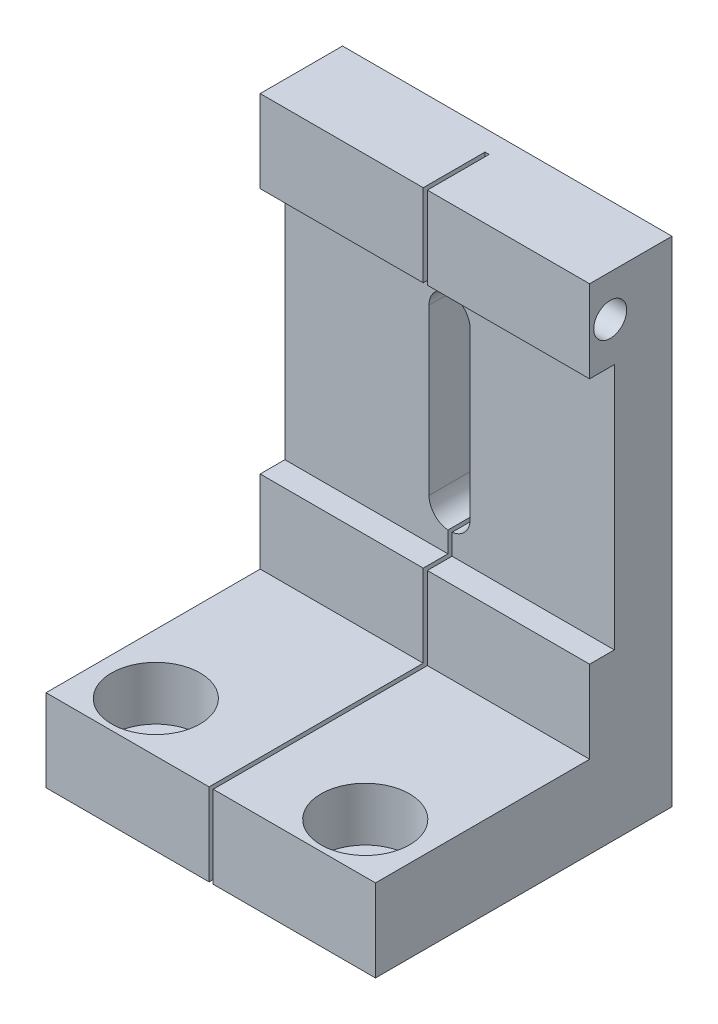
ISO-10303-21;
HEADER;
FILE_DESCRIPTION(('STEP AP214'),'2;1');
FILE_NAME('part.step','',(''),(''),'','','');
FILE_SCHEMA(('AUTOMOTIVE_DESIGN { 1 0 10303 214 1 1 1 1 }'));
ENDSEC;
DATA;
#1=APPLICATION_CONTEXT('core data for automotive mechanical design processes');
#2=APPLICATION_PROTOCOL_DEFINITION('international standard','automotive_design',2000,#1);
#3=PRODUCT_CONTEXT('',#1,'mechanical');
#4=PRODUCT('Part','Part','',(#3));
#5=PRODUCT_RELATED_PRODUCT_CATEGORY('part','',(#4));
#6=PRODUCT_DEFINITION_FORMATION('','',#4);
#7=PRODUCT_DEFINITION_CONTEXT('part definition',#1,'design');
#8=PRODUCT_DEFINITION('design','',#6,#7);
#9=PRODUCT_DEFINITION_SHAPE('','',#8);
#10=(LENGTH_UNIT() NAMED_UNIT(*) SI_UNIT(.MILLI.,.METRE.));
#11=(NAMED_UNIT(*) PLANE_ANGLE_UNIT() SI_UNIT($,.RADIAN.));
#12=(NAMED_UNIT(*) SI_UNIT($,.STERADIAN.) SOLID_ANGLE_UNIT());
#13=UNCERTAINTY_MEASURE_WITH_UNIT(LENGTH_MEASURE(1.E-05),#10,'distance_accuracy_value','');
#14=(GEOMETRIC_REPRESENTATION_CONTEXT(3) GLOBAL_UNCERTAINTY_ASSIGNED_CONTEXT((#13)) GLOBAL_UNIT_ASSIGNED_CONTEXT((#10,
#11,#12)) REPRESENTATION_CONTEXT('',''));
#15=CARTESIAN_POINT('',(0.,0.,0.));
#16=DIRECTION('',(0.,0.,1.));
#17=DIRECTION('',(1.,0.,0.));
#18=AXIS2_PLACEMENT_3D('',#15,#16,#17);
#19=CARTESIAN_POINT('',(-7.29999999999999,-40.383347775863,29.94));
#20=DIRECTION('',(0.,-1.,0.));
#21=DIRECTION('',(0.,0.,-1.));
#22=AXIS2_PLACEMENT_3D('',#19,#20,#21);
#23=CYLINDRICAL_SURFACE('',#22,3.4);
#24=CARTESIAN_POINT('',(-7.29999999999999,-60.,29.94));
#25=DIRECTION('',(0.,-1.,0.));
#26=DIRECTION('',(0.,0.,-1.));
#27=AXIS2_PLACEMENT_3D('',#24,#25,#26);
#28=CIRCLE('',#27,3.4);
#29=CARTESIAN_POINT('',(-7.29999999999999,-60.,26.54));
#30=VERTEX_POINT('',#29);
#31=EDGE_CURVE('E469',#30,#30,#28,.T.);
#32=ORIENTED_EDGE('',*,*,#31,.T.);
#33=EDGE_LOOP('',(#32));
#34=FACE_BOUND('',#33,.T.);
#35=CARTESIAN_POINT('',(-7.29999999999999,-56.5,29.94));
#36=DIRECTION('',(0.,1.,0.));
#37=DIRECTION('',(-1.,0.,0.));
#38=AXIS2_PLACEMENT_3D('',#35,#36,#37);
#39=CIRCLE('',#38,3.4);
#40=CARTESIAN_POINT('',(-10.7,-56.5,29.94));
#41=VERTEX_POINT('',#40);
#42=EDGE_CURVE('E39',#41,#41,#39,.F.);
#43=ORIENTED_EDGE('',*,*,#42,.F.);
#44=EDGE_LOOP('',(#43));
#45=FACE_BOUND('',#44,.T.);
#46=ADVANCED_FACE('F35',(#34,#45),#23,.F.);
#47=CARTESIAN_POINT('',(-32.73,-40.383347775863,29.94));
#48=DIRECTION('',(0.,-1.,0.));
#49=DIRECTION('',(0.,0.,-1.));
#50=AXIS2_PLACEMENT_3D('',#47,#48,#49);
#51=CYLINDRICAL_SURFACE('',#50,3.4);
#52=CARTESIAN_POINT('',(-32.73,-60.,29.94));
#53=DIRECTION('',(0.,-1.,0.));
#54=DIRECTION('',(0.,0.,-1.));
#55=AXIS2_PLACEMENT_3D('',#52,#53,#54);
#56=CIRCLE('',#55,3.4);
#57=CARTESIAN_POINT('',(-32.73,-60.,26.54));
#58=VERTEX_POINT('',#57);
#59=EDGE_CURVE('E460',#58,#58,#56,.T.);
#60=ORIENTED_EDGE('',*,*,#59,.T.);
#61=EDGE_LOOP('',(#60));
#62=FACE_BOUND('',#61,.T.);
#63=CARTESIAN_POINT('',(-32.73,-56.5,29.94));
#64=DIRECTION('',(0.,1.,0.));
#65=DIRECTION('',(-1.,0.,0.));
#66=AXIS2_PLACEMENT_3D('',#63,#64,#65);
#67=CIRCLE('',#66,3.4);
#68=CARTESIAN_POINT('',(-36.13,-56.5,29.94));
#69=VERTEX_POINT('',#68);
#70=EDGE_CURVE('E438',#69,#69,#67,.F.);
#71=ORIENTED_EDGE('',*,*,#70,.F.);
#72=EDGE_LOOP('',(#71));
#73=FACE_BOUND('',#72,.T.);
#74=ADVANCED_FACE('F583',(#62,#73),#51,.F.);
#75=CARTESIAN_POINT('',(0.,0.,10.));
#76=DIRECTION('',(0.,0.,-1.));
#77=DIRECTION('',(-1.,0.,0.));
#78=AXIS2_PLACEMENT_3D('',#75,#76,#77);
#79=PLANE('',#78);
#80=DIRECTION('',(1.,0.,0.));
#81=VECTOR('',#80,1.);
#82=CARTESIAN_POINT('',(-40.,-40.,10.));
#83=LINE('',#82,#81);
#84=CARTESIAN_POINT('',(-19.7,-40.,10.));
#85=VERTEX_POINT('',#84);
#86=CARTESIAN_POINT('',(0.,-40.,10.));
#87=VERTEX_POINT('',#86);
#88=EDGE_CURVE('E343',#85,#87,#83,.T.);
#89=ORIENTED_EDGE('',*,*,#88,.F.);
#90=DIRECTION('',(0.,-1.,0.));
#91=VECTOR('',#90,1.);
#92=CARTESIAN_POINT('',(-19.7,0.,10.));
#93=LINE('',#92,#91);
#94=CARTESIAN_POINT('',(-19.7,-50.,10.));
#95=VERTEX_POINT('',#94);
#96=EDGE_CURVE('E288',#85,#95,#93,.T.);
#97=ORIENTED_EDGE('',*,*,#96,.T.);
#98=DIRECTION('',(-1.,0.,0.));
#99=VECTOR('',#98,1.);
#100=CARTESIAN_POINT('',(0.,-50.,10.));
#101=LINE('',#100,#99);
#102=CARTESIAN_POINT('',(0.,-50.,10.));
#103=VERTEX_POINT('',#102);
#104=EDGE_CURVE('E313',#103,#95,#101,.T.);
#105=ORIENTED_EDGE('',*,*,#104,.F.);
#106=DIRECTION('',(0.,1.,0.));
#107=VECTOR('',#106,1.);
#108=CARTESIAN_POINT('',(0.,0.,10.));
#109=LINE('',#108,#107);
#110=EDGE_CURVE('E402',#103,#87,#109,.T.);
#111=ORIENTED_EDGE('',*,*,#110,.T.);
#112=EDGE_LOOP('',(#89,#97,#105,#111));
#113=FACE_BOUND('',#112,.T.);
#114=ADVANCED_FACE('F503',(#113),#79,.F.);
#115=DIRECTION('',(-1.,0.,0.));
#116=VECTOR('',#115,1.);
#117=CARTESIAN_POINT('',(0.,0.,10.));
#118=LINE('',#117,#116);
#119=CARTESIAN_POINT('',(0.,0.,10.));
#120=VERTEX_POINT('',#119);
#121=CARTESIAN_POINT('',(-19.7,0.,10.));
#122=VERTEX_POINT('',#121);
#123=EDGE_CURVE('E407',#120,#122,#118,.T.);
#124=ORIENTED_EDGE('',*,*,#123,.T.);
#125=DIRECTION('',(0.,-1.,0.));
#126=VECTOR('',#125,1.);
#127=CARTESIAN_POINT('',(-19.7,0.,10.));
#128=LINE('',#127,#126);
#129=CARTESIAN_POINT('',(-19.7,-10.,10.));
#130=VERTEX_POINT('',#129);
#131=EDGE_CURVE('E228',#122,#130,#128,.T.);
#132=ORIENTED_EDGE('',*,*,#131,.T.);
#133=DIRECTION('',(1.,0.,0.));
#134=VECTOR('',#133,1.);
#135=CARTESIAN_POINT('',(-40.,-10.,10.));
#136=LINE('',#135,#134);
#137=CARTESIAN_POINT('',(0.,-10.,10.));
#138=VERTEX_POINT('',#137);
#139=EDGE_CURVE('E355',#130,#138,#136,.T.);
#140=ORIENTED_EDGE('',*,*,#139,.T.);
#141=EDGE_CURVE('E406',#138,#120,#109,.T.);
#142=ORIENTED_EDGE('',*,*,#141,.T.);
#143=EDGE_LOOP('',(#124,#132,#140,#142));
#144=FACE_BOUND('',#143,.T.);
#145=ADVANCED_FACE('F536',(#144),#79,.F.);
#146=CARTESIAN_POINT('',(-40.,-10.,7.));
#147=DIRECTION('',(0.,0.,-1.));
#148=DIRECTION('',(0.,1.,0.));
#149=AXIS2_PLACEMENT_3D('',#146,#147,#148);
#150=PLANE('',#149);
#151=DIRECTION('',(1.,0.,0.));
#152=VECTOR('',#151,1.);
#153=CARTESIAN_POINT('',(-40.,-10.,7.));
#154=LINE('',#153,#152);
#155=CARTESIAN_POINT('',(-19.7,-10.,7.));
#156=VERTEX_POINT('',#155);
#157=CARTESIAN_POINT('',(0.,-10.,7.));
#158=VERTEX_POINT('',#157);
#159=EDGE_CURVE('E359',#156,#158,#154,.T.);
#160=ORIENTED_EDGE('',*,*,#159,.F.);
#161=DIRECTION('',(0.,-1.,0.));
#162=VECTOR('',#161,1.);
#163=CARTESIAN_POINT('',(-19.7,-10.,7.));
#164=LINE('',#163,#162);
#165=CARTESIAN_POINT('',(-19.7,-12.5180652708018,7.));
#166=VERTEX_POINT('',#165);
#167=EDGE_CURVE('E298',#156,#166,#164,.T.);
#168=ORIENTED_EDGE('',*,*,#167,.T.);
#169=CARTESIAN_POINT('',(-20.,-15.,7.));
#170=DIRECTION('',(0.,0.,-1.));
#171=DIRECTION('',(0.,1.,0.));
#172=AXIS2_PLACEMENT_3D('',#169,#170,#171);
#173=CIRCLE('',#172,2.5);
#174=CARTESIAN_POINT('',(-17.5,-15.,7.));
#175=VERTEX_POINT('',#174);
#176=EDGE_CURVE('E374',#175,#166,#173,.F.);
#177=ORIENTED_EDGE('',*,*,#176,.F.);
#178=DIRECTION('',(0.,1.,0.));
#179=VECTOR('',#178,1.);
#180=CARTESIAN_POINT('',(-17.5,-15.,7.));
#181=LINE('',#180,#179);
#182=CARTESIAN_POINT('',(-17.5,-35.,7.));
#183=VERTEX_POINT('',#182);
#184=EDGE_CURVE('E370',#183,#175,#181,.T.);
#185=ORIENTED_EDGE('',*,*,#184,.F.);
#186=CARTESIAN_POINT('',(-20.,-35.,7.));
#187=DIRECTION('',(0.,0.,-1.));
#188=DIRECTION('',(0.,1.,0.));
#189=AXIS2_PLACEMENT_3D('',#186,#187,#188);
#190=CIRCLE('',#189,2.5);
#191=CARTESIAN_POINT('',(-19.7,-37.4819347291982,7.));
#192=VERTEX_POINT('',#191);
#193=EDGE_CURVE('E354',#192,#183,#190,.F.);
#194=ORIENTED_EDGE('',*,*,#193,.F.);
#195=CARTESIAN_POINT('',(-19.7,-40.,7.));
#196=VERTEX_POINT('',#195);
#197=EDGE_CURVE('E294',#192,#196,#164,.T.);
#198=ORIENTED_EDGE('',*,*,#197,.T.);
#199=DIRECTION('',(1.,0.,0.));
#200=VECTOR('',#199,1.);
#201=CARTESIAN_POINT('',(-40.,-40.,7.));
#202=LINE('',#201,#200);
#203=CARTESIAN_POINT('',(0.,-40.,7.));
#204=VERTEX_POINT('',#203);
#205=EDGE_CURVE('E363',#196,#204,#202,.T.);
#206=ORIENTED_EDGE('',*,*,#205,.T.);
#207=DIRECTION('',(0.,1.,0.));
#208=VECTOR('',#207,1.);
#209=CARTESIAN_POINT('',(0.,-10.,7.));
#210=LINE('',#209,#208);
#211=EDGE_CURVE('E346',#204,#158,#210,.T.);
#212=ORIENTED_EDGE('',*,*,#211,.T.);
#213=EDGE_LOOP('',(#160,#168,#177,#185,#194,#198,#206,#212));
#214=FACE_BOUND('',#213,.T.);
#215=ADVANCED_FACE('F511',(#214),#150,.F.);
#216=CARTESIAN_POINT('',(-40.,-10.,7.));
#217=DIRECTION('',(0.,1.,0.));
#218=DIRECTION('',(-1.,0.,0.));
#219=AXIS2_PLACEMENT_3D('',#216,#217,#218);
#220=PLANE('',#219);
#221=ORIENTED_EDGE('',*,*,#139,.F.);
#222=DIRECTION('',(0.,0.,-1.));
#223=VECTOR('',#222,1.);
#224=CARTESIAN_POINT('',(-19.7,-10.,7.));
#225=LINE('',#224,#223);
#226=EDGE_CURVE('E301',#130,#156,#225,.T.);
#227=ORIENTED_EDGE('',*,*,#226,.T.);
#228=ORIENTED_EDGE('',*,*,#159,.T.);
#229=DIRECTION('',(0.,0.,1.));
#230=VECTOR('',#229,1.);
#231=CARTESIAN_POINT('',(0.,-10.,7.));
#232=LINE('',#231,#230);
#233=EDGE_CURVE('E337',#158,#138,#232,.T.);
#234=ORIENTED_EDGE('',*,*,#233,.T.);
#235=EDGE_LOOP('',(#221,#227,#228,#234));
#236=FACE_BOUND('',#235,.T.);
#237=ADVANCED_FACE('F539',(#236),#220,.F.);
#238=CARTESIAN_POINT('',(-40.,-40.,7.));
#239=DIRECTION('',(0.,-1.,0.));
#240=DIRECTION('',(1.,0.,0.));
#241=AXIS2_PLACEMENT_3D('',#238,#239,#240);
#242=PLANE('',#241);
#243=ORIENTED_EDGE('',*,*,#205,.F.);
#244=DIRECTION('',(0.,0.,1.));
#245=VECTOR('',#244,1.);
#246=CARTESIAN_POINT('',(-19.7,-40.,7.));
#247=LINE('',#246,#245);
#248=EDGE_CURVE('E291',#196,#85,#247,.T.);
#249=ORIENTED_EDGE('',*,*,#248,.T.);
#250=ORIENTED_EDGE('',*,*,#88,.T.);
#251=DIRECTION('',(0.,0.,-1.));
#252=VECTOR('',#251,1.);
#253=CARTESIAN_POINT('',(0.,-40.,7.));
#254=LINE('',#253,#252);
#255=EDGE_CURVE('E332',#87,#204,#254,.T.);
#256=ORIENTED_EDGE('',*,*,#255,.T.);
#257=EDGE_LOOP('',(#243,#249,#250,#256));
#258=FACE_BOUND('',#257,.T.);
#259=ADVANCED_FACE('F506',(#258),#242,.F.);
#260=CARTESIAN_POINT('',(0.,-50.,36.));
#261=DIRECTION('',(0.,-1.,0.));
#262=DIRECTION('',(1.,0.,0.));
#263=AXIS2_PLACEMENT_3D('',#260,#261,#262);
#264=PLANE('',#263);
#265=CARTESIAN_POINT('',(-7.29999999999999,-50.,29.94));
#266=DIRECTION('',(0.,1.,0.));
#267=DIRECTION('',(-1.,0.,0.));
#268=AXIS2_PLACEMENT_3D('',#265,#266,#267);
#269=CIRCLE('',#268,5.375);
#270=CARTESIAN_POINT('',(-12.675,-50.,29.94));
#271=VERTEX_POINT('',#270);
#272=EDGE_CURVE('E455',#271,#271,#269,.T.);
#273=ORIENTED_EDGE('',*,*,#272,.F.);
#274=EDGE_LOOP('',(#273));
#275=FACE_BOUND('',#274,.T.);
#276=ORIENTED_EDGE('',*,*,#104,.T.);
#277=DIRECTION('',(0.,0.,1.));
#278=VECTOR('',#277,1.);
#279=CARTESIAN_POINT('',(-19.7,-50.,36.));
#280=LINE('',#279,#278);
#281=CARTESIAN_POINT('',(-19.7,-50.,36.));
#282=VERTEX_POINT('',#281);
#283=EDGE_CURVE('E285',#95,#282,#280,.T.);
#284=ORIENTED_EDGE('',*,*,#283,.T.);
#285=DIRECTION('',(-1.,0.,0.));
#286=VECTOR('',#285,1.);
#287=CARTESIAN_POINT('',(0.,-50.,36.));
#288=LINE('',#287,#286);
#289=CARTESIAN_POINT('',(0.,-50.,36.));
#290=VERTEX_POINT('',#289);
#291=EDGE_CURVE('E314',#290,#282,#288,.T.);
#292=ORIENTED_EDGE('',*,*,#291,.F.);
#293=DIRECTION('',(0.,0.,-1.));
#294=VECTOR('',#293,1.);
#295=CARTESIAN_POINT('',(0.,-50.,36.));
#296=LINE('',#295,#294);
#297=EDGE_CURVE('E329',#290,#103,#296,.T.);
#298=ORIENTED_EDGE('',*,*,#297,.T.);
#299=EDGE_LOOP('',(#276,#284,#292,#298));
#300=FACE_BOUND('',#299,.T.);
#301=ADVANCED_FACE('F500',(#275,#300),#264,.F.);
#302=CARTESIAN_POINT('',(0.,0.,36.));
#303=DIRECTION('',(0.,0.,1.));
#304=DIRECTION('',(1.,0.,0.));
#305=AXIS2_PLACEMENT_3D('',#302,#303,#304);
#306=PLANE('',#305);
#307=DIRECTION('',(0.,1.,0.));
#308=VECTOR('',#307,1.);
#309=CARTESIAN_POINT('',(-19.7,-93.5037311355019,36.));
#310=LINE('',#309,#308);
#311=CARTESIAN_POINT('',(-19.7,-60.,36.));
#312=VERTEX_POINT('',#311);
#313=EDGE_CURVE('E252',#312,#282,#310,.T.);
#314=ORIENTED_EDGE('',*,*,#313,.F.);
#315=DIRECTION('',(1.,0.,0.));
#316=VECTOR('',#315,1.);
#317=CARTESIAN_POINT('',(0.,-60.,36.));
#318=LINE('',#317,#316);
#319=CARTESIAN_POINT('',(0.,-60.,36.));
#320=VERTEX_POINT('',#319);
#321=EDGE_CURVE('E320',#312,#320,#318,.T.);
#322=ORIENTED_EDGE('',*,*,#321,.T.);
#323=DIRECTION('',(0.,1.,0.));
#324=VECTOR('',#323,1.);
#325=CARTESIAN_POINT('',(0.,-60.,36.));
#326=LINE('',#325,#324);
#327=EDGE_CURVE('E309',#320,#290,#326,.T.);
#328=ORIENTED_EDGE('',*,*,#327,.T.);
#329=ORIENTED_EDGE('',*,*,#291,.T.);
#330=EDGE_LOOP('',(#314,#322,#328,#329));
#331=FACE_BOUND('',#330,.T.);
#332=ADVANCED_FACE('F488',(#331),#306,.T.);
#333=CARTESIAN_POINT('',(-20.2,-50.,10.));
#334=VERTEX_POINT('',#333);
#335=CARTESIAN_POINT('',(-40.,-50.,10.));
#336=VERTEX_POINT('',#335);
#337=EDGE_CURVE('E308',#334,#336,#101,.T.);
#338=ORIENTED_EDGE('',*,*,#337,.F.);
#339=DIRECTION('',(0.,1.,0.));
#340=VECTOR('',#339,1.);
#341=CARTESIAN_POINT('',(-20.2,0.,10.));
#342=LINE('',#341,#340);
#343=CARTESIAN_POINT('',(-20.2,-40.,10.));
#344=VERTEX_POINT('',#343);
#345=EDGE_CURVE('E266',#334,#344,#342,.T.);
#346=ORIENTED_EDGE('',*,*,#345,.T.);
#347=CARTESIAN_POINT('',(-40.,-40.,10.));
#348=VERTEX_POINT('',#347);
#349=EDGE_CURVE('E364',#348,#344,#83,.T.);
#350=ORIENTED_EDGE('',*,*,#349,.F.);
#351=DIRECTION('',(0.,-1.,0.));
#352=VECTOR('',#351,1.);
#353=CARTESIAN_POINT('',(-40.,0.,10.));
#354=LINE('',#353,#352);
#355=EDGE_CURVE('E409',#348,#336,#354,.T.);
#356=ORIENTED_EDGE('',*,*,#355,.T.);
#357=EDGE_LOOP('',(#338,#346,#350,#356));
#358=FACE_BOUND('',#357,.T.);
#359=ADVANCED_FACE('F565',(#358),#79,.F.);
#360=CARTESIAN_POINT('',(-40.,-10.,10.));
#361=VERTEX_POINT('',#360);
#362=CARTESIAN_POINT('',(-20.2,-10.,10.));
#363=VERTEX_POINT('',#362);
#364=EDGE_CURVE('E351',#361,#363,#136,.T.);
#365=ORIENTED_EDGE('',*,*,#364,.T.);
#366=DIRECTION('',(0.,1.,0.));
#367=VECTOR('',#366,1.);
#368=CARTESIAN_POINT('',(-20.2,0.,10.));
#369=LINE('',#368,#367);
#370=CARTESIAN_POINT('',(-20.2,0.,10.));
#371=VERTEX_POINT('',#370);
#372=EDGE_CURVE('E52',#363,#371,#369,.T.);
#373=ORIENTED_EDGE('',*,*,#372,.T.);
#374=CARTESIAN_POINT('',(-40.,0.,10.));
#375=VERTEX_POINT('',#374);
#376=EDGE_CURVE('E405',#371,#375,#118,.T.);
#377=ORIENTED_EDGE('',*,*,#376,.T.);
#378=EDGE_CURVE('E410',#375,#361,#354,.T.);
#379=ORIENTED_EDGE('',*,*,#378,.T.);
#380=EDGE_LOOP('',(#365,#373,#377,#379));
#381=FACE_BOUND('',#380,.T.);
#382=ADVANCED_FACE('F637',(#381),#79,.F.);
#383=CARTESIAN_POINT('',(0.,0.,10.));
#384=DIRECTION('',(-1.,0.,0.));
#385=DIRECTION('',(0.,-1.,0.));
#386=AXIS2_PLACEMENT_3D('',#383,#384,#385);
#387=PLANE('',#386);
#388=CARTESIAN_POINT('',(0.,-5.,7.5));
#389=DIRECTION('',(1.,0.,0.));
#390=DIRECTION('',(0.,1.,0.));
#391=AXIS2_PLACEMENT_3D('',#388,#389,#390);
#392=CIRCLE('',#391,2.);
#393=CARTESIAN_POINT('',(0.,-3.,7.5));
#394=VERTEX_POINT('',#393);
#395=EDGE_CURVE('E472',#394,#394,#392,.T.);
#396=ORIENTED_EDGE('',*,*,#395,.F.);
#397=EDGE_LOOP('',(#396));
#398=FACE_BOUND('',#397,.T.);
#399=ORIENTED_EDGE('',*,*,#141,.F.);
#400=ORIENTED_EDGE('',*,*,#233,.F.);
#401=ORIENTED_EDGE('',*,*,#211,.F.);
#402=ORIENTED_EDGE('',*,*,#255,.F.);
#403=ORIENTED_EDGE('',*,*,#110,.F.);
#404=ORIENTED_EDGE('',*,*,#297,.F.);
#405=ORIENTED_EDGE('',*,*,#327,.F.);
#406=DIRECTION('',(0.,0.,-1.));
#407=VECTOR('',#406,1.);
#408=CARTESIAN_POINT('',(0.,-60.,10.));
#409=LINE('',#408,#407);
#410=CARTESIAN_POINT('',(0.,-60.,0.));
#411=VERTEX_POINT('',#410);
#412=EDGE_CURVE('E413',#320,#411,#409,.T.);
#413=ORIENTED_EDGE('',*,*,#412,.T.);
#414=DIRECTION('',(0.,1.,0.));
#415=VECTOR('',#414,1.);
#416=CARTESIAN_POINT('',(0.,0.,0.));
#417=LINE('',#416,#415);
#418=CARTESIAN_POINT('',(0.,0.,0.));
#419=VERTEX_POINT('',#418);
#420=EDGE_CURVE('E393',#411,#419,#417,.T.);
#421=ORIENTED_EDGE('',*,*,#420,.T.);
#422=DIRECTION('',(0.,0.,-1.));
#423=VECTOR('',#422,1.);
#424=CARTESIAN_POINT('',(0.,0.,10.));
#425=LINE('',#424,#423);
#426=EDGE_CURVE('E430',#120,#419,#425,.T.);
#427=ORIENTED_EDGE('',*,*,#426,.F.);
#428=EDGE_LOOP('',(#399,#400,#401,#402,#403,#404,#405,#413,#421,#427));
#429=FACE_BOUND('',#428,.T.);
#430=ADVANCED_FACE('F37',(#398,#429),#387,.F.);
#431=CARTESIAN_POINT('',(0.,0.,10.));
#432=DIRECTION('',(0.,-1.,0.));
#433=DIRECTION('',(1.,0.,0.));
#434=AXIS2_PLACEMENT_3D('',#431,#432,#433);
#435=PLANE('',#434);
#436=DIRECTION('',(-1.,0.,0.));
#437=VECTOR('',#436,1.);
#438=CARTESIAN_POINT('',(-20.2,0.,2.5));
#439=LINE('',#438,#437);
#440=CARTESIAN_POINT('',(-19.7,0.,2.5));
#441=VERTEX_POINT('',#440);
#442=CARTESIAN_POINT('',(-20.2,0.,2.5));
#443=VERTEX_POINT('',#442);
#444=EDGE_CURVE('E233',#441,#443,#439,.T.);
#445=ORIENTED_EDGE('',*,*,#444,.F.);
#446=DIRECTION('',(0.,0.,-1.));
#447=VECTOR('',#446,1.);
#448=CARTESIAN_POINT('',(-19.7,0.,36.));
#449=LINE('',#448,#447);
#450=EDGE_CURVE('E222',#122,#441,#449,.T.);
#451=ORIENTED_EDGE('',*,*,#450,.F.);
#452=ORIENTED_EDGE('',*,*,#123,.F.);
#453=ORIENTED_EDGE('',*,*,#426,.T.);
#454=DIRECTION('',(-1.,0.,0.));
#455=VECTOR('',#454,1.);
#456=CARTESIAN_POINT('',(0.,0.,0.));
#457=LINE('',#456,#455);
#458=CARTESIAN_POINT('',(-40.,0.,0.));
#459=VERTEX_POINT('',#458);
#460=EDGE_CURVE('E416',#419,#459,#457,.T.);
#461=ORIENTED_EDGE('',*,*,#460,.T.);
#462=DIRECTION('',(0.,0.,-1.));
#463=VECTOR('',#462,1.);
#464=CARTESIAN_POINT('',(-40.,0.,10.));
#465=LINE('',#464,#463);
#466=EDGE_CURVE('E427',#375,#459,#465,.T.);
#467=ORIENTED_EDGE('',*,*,#466,.F.);
#468=ORIENTED_EDGE('',*,*,#376,.F.);
#469=DIRECTION('',(0.,0.,1.));
#470=VECTOR('',#469,1.);
#471=CARTESIAN_POINT('',(-20.2,0.,36.));
#472=LINE('',#471,#470);
#473=EDGE_CURVE('E244',#443,#371,#472,.T.);
#474=ORIENTED_EDGE('',*,*,#473,.F.);
#475=EDGE_LOOP('',(#445,#451,#452,#453,#461,#467,#468,#474));
#476=FACE_BOUND('',#475,.T.);
#477=ADVANCED_FACE('F246',(#476),#435,.F.);
#478=CARTESIAN_POINT('',(-40.,0.,10.));
#479=DIRECTION('',(1.,0.,0.));
#480=DIRECTION('',(0.,1.,0.));
#481=AXIS2_PLACEMENT_3D('',#478,#479,#480);
#482=PLANE('',#481);
#483=DIRECTION('',(0.,1.,0.));
#484=VECTOR('',#483,1.);
#485=CARTESIAN_POINT('',(-40.,-10.,7.));
#486=LINE('',#485,#484);
#487=CARTESIAN_POINT('',(-40.,-40.,7.));
#488=VERTEX_POINT('',#487);
#489=CARTESIAN_POINT('',(-40.,-10.,7.));
#490=VERTEX_POINT('',#489);
#491=EDGE_CURVE('E336',#488,#490,#486,.T.);
#492=ORIENTED_EDGE('',*,*,#491,.T.);
#493=DIRECTION('',(0.,0.,1.));
#494=VECTOR('',#493,1.);
#495=CARTESIAN_POINT('',(-40.,-10.,7.));
#496=LINE('',#495,#494);
#497=EDGE_CURVE('E340',#490,#361,#496,.T.);
#498=ORIENTED_EDGE('',*,*,#497,.T.);
#499=ORIENTED_EDGE('',*,*,#378,.F.);
#500=ORIENTED_EDGE('',*,*,#466,.T.);
#501=DIRECTION('',(0.,-1.,0.));
#502=VECTOR('',#501,1.);
#503=CARTESIAN_POINT('',(-40.,0.,0.));
#504=LINE('',#503,#502);
#505=CARTESIAN_POINT('',(-40.,-60.,0.));
#506=VERTEX_POINT('',#505);
#507=EDGE_CURVE('E418',#459,#506,#504,.T.);
#508=ORIENTED_EDGE('',*,*,#507,.T.);
#509=DIRECTION('',(0.,0.,-1.));
#510=VECTOR('',#509,1.);
#511=CARTESIAN_POINT('',(-40.,-60.,10.));
#512=LINE('',#511,#510);
#513=CARTESIAN_POINT('',(-40.,-60.,36.));
#514=VERTEX_POINT('',#513);
#515=EDGE_CURVE('E424',#514,#506,#512,.T.);
#516=ORIENTED_EDGE('',*,*,#515,.F.);
#517=DIRECTION('',(0.,-1.,0.));
#518=VECTOR('',#517,1.);
#519=CARTESIAN_POINT('',(-40.,-60.,36.));
#520=LINE('',#519,#518);
#521=CARTESIAN_POINT('',(-40.,-50.,36.));
#522=VERTEX_POINT('',#521);
#523=EDGE_CURVE('E317',#522,#514,#520,.T.);
#524=ORIENTED_EDGE('',*,*,#523,.F.);
#525=DIRECTION('',(0.,0.,-1.));
#526=VECTOR('',#525,1.);
#527=CARTESIAN_POINT('',(-40.,-50.,36.));
#528=LINE('',#527,#526);
#529=EDGE_CURVE('E324',#522,#336,#528,.T.);
#530=ORIENTED_EDGE('',*,*,#529,.T.);
#531=ORIENTED_EDGE('',*,*,#355,.F.);
#532=DIRECTION('',(0.,0.,-1.));
#533=VECTOR('',#532,1.);
#534=CARTESIAN_POINT('',(-40.,-40.,7.));
#535=LINE('',#534,#533);
#536=EDGE_CURVE('E333',#348,#488,#535,.T.);
#537=ORIENTED_EDGE('',*,*,#536,.T.);
#538=EDGE_LOOP('',(#492,#498,#499,#500,#508,#516,#524,#530,#531,#537));
#539=FACE_BOUND('',#538,.T.);
#540=ADVANCED_FACE('F527',(#539),#482,.F.);
#541=CARTESIAN_POINT('',(0.,-60.,10.));
#542=DIRECTION('',(0.,1.,0.));
#543=DIRECTION('',(0.,0.,1.));
#544=AXIS2_PLACEMENT_3D('',#541,#542,#543);
#545=PLANE('',#544);
#546=CARTESIAN_POINT('',(-7.29999999999999,-60.,4.50999999999999));
#547=DIRECTION('',(0.,-1.,0.));
#548=DIRECTION('',(0.,0.,-1.));
#549=AXIS2_PLACEMENT_3D('',#546,#547,#548);
#550=CIRCLE('',#549,2.49);
#551=CARTESIAN_POINT('',(-7.29999999999999,-60.,2.01999999999999));
#552=VERTEX_POINT('',#551);
#553=EDGE_CURVE('E440',#552,#552,#550,.T.);
#554=ORIENTED_EDGE('',*,*,#553,.F.);
#555=EDGE_LOOP('',(#554));
#556=FACE_BOUND('',#555,.T.);
#557=ORIENTED_EDGE('',*,*,#59,.F.);
#558=EDGE_LOOP('',(#557));
#559=FACE_BOUND('',#558,.T.);
#560=CARTESIAN_POINT('',(-32.73,-60.,4.50999999999999));
#561=DIRECTION('',(0.,-1.,0.));
#562=DIRECTION('',(0.,0.,-1.));
#563=AXIS2_PLACEMENT_3D('',#560,#561,#562);
#564=CIRCLE('',#563,2.49);
#565=CARTESIAN_POINT('',(-32.73,-60.,2.01999999999999));
#566=VERTEX_POINT('',#565);
#567=EDGE_CURVE('E463',#566,#566,#564,.T.);
#568=ORIENTED_EDGE('',*,*,#567,.F.);
#569=EDGE_LOOP('',(#568));
#570=FACE_BOUND('',#569,.T.);
#571=ORIENTED_EDGE('',*,*,#31,.F.);
#572=EDGE_LOOP('',(#571));
#573=FACE_BOUND('',#572,.T.);
#574=ORIENTED_EDGE('',*,*,#321,.F.);
#575=DIRECTION('',(0.,0.,1.));
#576=VECTOR('',#575,1.);
#577=CARTESIAN_POINT('',(-19.7,-60.,36.));
#578=LINE('',#577,#576);
#579=CARTESIAN_POINT('',(-19.7,-60.,2.5));
#580=VERTEX_POINT('',#579);
#581=EDGE_CURVE('E264',#580,#312,#578,.T.);
#582=ORIENTED_EDGE('',*,*,#581,.F.);
#583=DIRECTION('',(1.,0.,0.));
#584=VECTOR('',#583,1.);
#585=CARTESIAN_POINT('',(-20.2,-60.,2.5));
#586=LINE('',#585,#584);
#587=CARTESIAN_POINT('',(-20.2,-60.,2.5));
#588=VERTEX_POINT('',#587);
#589=EDGE_CURVE('E262',#588,#580,#586,.T.);
#590=ORIENTED_EDGE('',*,*,#589,.F.);
#591=DIRECTION('',(0.,0.,-1.));
#592=VECTOR('',#591,1.);
#593=CARTESIAN_POINT('',(-20.2,-60.,36.));
#594=LINE('',#593,#592);
#595=CARTESIAN_POINT('',(-20.2,-60.,36.));
#596=VERTEX_POINT('',#595);
#597=EDGE_CURVE('E254',#596,#588,#594,.T.);
#598=ORIENTED_EDGE('',*,*,#597,.F.);
#599=EDGE_CURVE('E321',#514,#596,#318,.T.);
#600=ORIENTED_EDGE('',*,*,#599,.F.);
#601=ORIENTED_EDGE('',*,*,#515,.T.);
#602=DIRECTION('',(1.,0.,0.));
#603=VECTOR('',#602,1.);
#604=CARTESIAN_POINT('',(0.,-60.,0.));
#605=LINE('',#604,#603);
#606=EDGE_CURVE('E420',#506,#411,#605,.T.);
#607=ORIENTED_EDGE('',*,*,#606,.T.);
#608=ORIENTED_EDGE('',*,*,#412,.F.);
#609=EDGE_LOOP('',(#574,#582,#590,#598,#600,#601,#607,#608));
#610=FACE_BOUND('',#609,.T.);
#611=ADVANCED_FACE('F490',(#556,#559,#570,#573,#610),#545,.F.);
#612=CARTESIAN_POINT('',(0.,0.,0.));
#613=DIRECTION('',(0.,0.,-1.));
#614=DIRECTION('',(-1.,0.,0.));
#615=AXIS2_PLACEMENT_3D('',#612,#613,#614);
#616=PLANE('',#615);
#617=CARTESIAN_POINT('',(-20.,-15.,0.));
#618=DIRECTION('',(0.,0.,1.));
#619=DIRECTION('',(1.,0.,0.));
#620=AXIS2_PLACEMENT_3D('',#617,#618,#619);
#621=CIRCLE('',#620,2.5);
#622=CARTESIAN_POINT('',(-17.5,-15.,0.));
#623=VERTEX_POINT('',#622);
#624=CARTESIAN_POINT('',(-22.5,-15.,0.));
#625=VERTEX_POINT('',#624);
#626=EDGE_CURVE('E377',#623,#625,#621,.T.);
#627=ORIENTED_EDGE('',*,*,#626,.T.);
#628=DIRECTION('',(0.,-1.,0.));
#629=VECTOR('',#628,1.);
#630=CARTESIAN_POINT('',(-22.5,-15.,0.));
#631=LINE('',#630,#629);
#632=CARTESIAN_POINT('',(-22.5,-35.,0.));
#633=VERTEX_POINT('',#632);
#634=EDGE_CURVE('E380',#625,#633,#631,.T.);
#635=ORIENTED_EDGE('',*,*,#634,.T.);
#636=CARTESIAN_POINT('',(-20.,-35.,0.));
#637=DIRECTION('',(0.,0.,1.));
#638=DIRECTION('',(1.,0.,0.));
#639=AXIS2_PLACEMENT_3D('',#636,#637,#638);
#640=CIRCLE('',#639,2.5);
#641=CARTESIAN_POINT('',(-17.5,-35.,0.));
#642=VERTEX_POINT('',#641);
#643=EDGE_CURVE('E383',#633,#642,#640,.T.);
#644=ORIENTED_EDGE('',*,*,#643,.T.);
#645=DIRECTION('',(0.,1.,0.));
#646=VECTOR('',#645,1.);
#647=CARTESIAN_POINT('',(-17.5,-15.,0.));
#648=LINE('',#647,#646);
#649=EDGE_CURVE('E386',#642,#623,#648,.T.);
#650=ORIENTED_EDGE('',*,*,#649,.T.);
#651=EDGE_LOOP('',(#627,#635,#644,#650));
#652=FACE_BOUND('',#651,.T.);
#653=ORIENTED_EDGE('',*,*,#420,.F.);
#654=ORIENTED_EDGE('',*,*,#606,.F.);
#655=ORIENTED_EDGE('',*,*,#507,.F.);
#656=ORIENTED_EDGE('',*,*,#460,.F.);
#657=EDGE_LOOP('',(#653,#654,#655,#656));
#658=FACE_BOUND('',#657,.T.);
#659=ADVANCED_FACE('F531',(#652,#658),#616,.T.);
#660=CARTESIAN_POINT('',(-20.,-15.,0.));
#661=DIRECTION('',(0.,0.,1.));
#662=DIRECTION('',(1.,0.,0.));
#663=AXIS2_PLACEMENT_3D('',#660,#661,#662);
#664=CYLINDRICAL_SURFACE('',#663,2.5);
#665=ORIENTED_EDGE('',*,*,#176,.T.);
#666=DIRECTION('',(0.,0.,1.));
#667=VECTOR('',#666,1.);
#668=CARTESIAN_POINT('',(-19.7,-12.5180652708018,0.));
#669=LINE('',#668,#667);
#670=CARTESIAN_POINT('',(-19.7,-12.5180652708018,2.5));
#671=VERTEX_POINT('',#670);
#672=EDGE_CURVE('E304',#166,#671,#669,.F.);
#673=ORIENTED_EDGE('',*,*,#672,.T.);
#674=CARTESIAN_POINT('',(-20.,-15.,2.5));
#675=DIRECTION('',(0.,0.,-1.));
#676=DIRECTION('',(-1.,0.,0.));
#677=AXIS2_PLACEMENT_3D('',#674,#675,#676);
#678=CIRCLE('',#677,2.5);
#679=CARTESIAN_POINT('',(-20.2,-12.5080128411246,2.5));
#680=VERTEX_POINT('',#679);
#681=EDGE_CURVE('E242',#671,#680,#678,.F.);
#682=ORIENTED_EDGE('',*,*,#681,.T.);
#683=DIRECTION('',(0.,0.,1.));
#684=VECTOR('',#683,1.);
#685=CARTESIAN_POINT('',(-20.2,-12.5080128411246,0.));
#686=LINE('',#685,#684);
#687=CARTESIAN_POINT('',(-20.2,-12.5080128411246,7.));
#688=VERTEX_POINT('',#687);
#689=EDGE_CURVE('E281',#680,#688,#686,.T.);
#690=ORIENTED_EDGE('',*,*,#689,.T.);
#691=CARTESIAN_POINT('',(-22.5,-15.,7.));
#692=VERTEX_POINT('',#691);
#693=EDGE_CURVE('E373',#688,#692,#173,.F.);
#694=ORIENTED_EDGE('',*,*,#693,.T.);
#695=DIRECTION('',(0.,0.,1.));
#696=VECTOR('',#695,1.);
#697=CARTESIAN_POINT('',(-22.5,-15.,0.));
#698=LINE('',#697,#696);
#699=EDGE_CURVE('E389',#625,#692,#698,.T.);
#700=ORIENTED_EDGE('',*,*,#699,.F.);
#701=ORIENTED_EDGE('',*,*,#626,.F.);
#702=DIRECTION('',(0.,0.,1.));
#703=VECTOR('',#702,1.);
#704=CARTESIAN_POINT('',(-17.5,-15.,0.));
#705=LINE('',#704,#703);
#706=EDGE_CURVE('E390',#623,#175,#705,.T.);
#707=ORIENTED_EDGE('',*,*,#706,.T.);
#708=EDGE_LOOP('',(#665,#673,#682,#690,#694,#700,#701,#707));
#709=FACE_BOUND('',#708,.T.);
#710=ADVANCED_FACE('F542',(#709),#664,.F.);
#711=CARTESIAN_POINT('',(-17.5,-15.,0.));
#712=DIRECTION('',(1.,0.,0.));
#713=DIRECTION('',(0.,0.,-1.));
#714=AXIS2_PLACEMENT_3D('',#711,#712,#713);
#715=PLANE('',#714);
#716=DIRECTION('',(0.,0.,1.));
#717=VECTOR('',#716,1.);
#718=CARTESIAN_POINT('',(-17.5,-35.,0.));
#719=LINE('',#718,#717);
#720=EDGE_CURVE('E394',#642,#183,#719,.T.);
#721=ORIENTED_EDGE('',*,*,#720,.T.);
#722=ORIENTED_EDGE('',*,*,#184,.T.);
#723=ORIENTED_EDGE('',*,*,#706,.F.);
#724=ORIENTED_EDGE('',*,*,#649,.F.);
#725=EDGE_LOOP('',(#721,#722,#723,#724));
#726=FACE_BOUND('',#725,.T.);
#727=ADVANCED_FACE('F545',(#726),#715,.F.);
#728=CARTESIAN_POINT('',(-20.,-35.,0.));
#729=DIRECTION('',(0.,0.,1.));
#730=DIRECTION('',(1.,0.,0.));
#731=AXIS2_PLACEMENT_3D('',#728,#729,#730);
#732=CYLINDRICAL_SURFACE('',#731,2.5);
#733=CARTESIAN_POINT('',(-20.,-35.,2.5));
#734=DIRECTION('',(0.,0.,-1.));
#735=DIRECTION('',(-1.,0.,0.));
#736=AXIS2_PLACEMENT_3D('',#733,#734,#735);
#737=CIRCLE('',#736,2.5);
#738=CARTESIAN_POINT('',(-20.2,-37.4919871588754,2.5));
#739=VERTEX_POINT('',#738);
#740=CARTESIAN_POINT('',(-19.7,-37.4819347291982,2.5));
#741=VERTEX_POINT('',#740);
#742=EDGE_CURVE('E11',#739,#741,#737,.F.);
#743=ORIENTED_EDGE('',*,*,#742,.T.);
#744=DIRECTION('',(0.,0.,1.));
#745=VECTOR('',#744,1.);
#746=CARTESIAN_POINT('',(-19.7,-37.4819347291982,0.));
#747=LINE('',#746,#745);
#748=EDGE_CURVE('E297',#741,#192,#747,.T.);
#749=ORIENTED_EDGE('',*,*,#748,.T.);
#750=ORIENTED_EDGE('',*,*,#193,.T.);
#751=ORIENTED_EDGE('',*,*,#720,.F.);
#752=ORIENTED_EDGE('',*,*,#643,.F.);
#753=DIRECTION('',(0.,0.,1.));
#754=VECTOR('',#753,1.);
#755=CARTESIAN_POINT('',(-22.5,-35.,0.));
#756=LINE('',#755,#754);
#757=CARTESIAN_POINT('',(-22.5,-35.,7.));
#758=VERTEX_POINT('',#757);
#759=EDGE_CURVE('E397',#633,#758,#756,.T.);
#760=ORIENTED_EDGE('',*,*,#759,.T.);
#761=CARTESIAN_POINT('',(-20.2,-37.4919871588754,7.));
#762=VERTEX_POINT('',#761);
#763=EDGE_CURVE('E367',#758,#762,#190,.F.);
#764=ORIENTED_EDGE('',*,*,#763,.T.);
#765=DIRECTION('',(0.,0.,1.));
#766=VECTOR('',#765,1.);
#767=CARTESIAN_POINT('',(-20.2,-37.4919871588754,0.));
#768=LINE('',#767,#766);
#769=EDGE_CURVE('E275',#762,#739,#768,.F.);
#770=ORIENTED_EDGE('',*,*,#769,.T.);
#771=EDGE_LOOP('',(#743,#749,#750,#751,#752,#760,#764,#770));
#772=FACE_BOUND('',#771,.T.);
#773=ADVANCED_FACE('F514',(#772),#732,.F.);
#774=CARTESIAN_POINT('',(-22.5,-15.,0.));
#775=DIRECTION('',(-1.,0.,0.));
#776=DIRECTION('',(0.,0.,1.));
#777=AXIS2_PLACEMENT_3D('',#774,#775,#776);
#778=PLANE('',#777);
#779=ORIENTED_EDGE('',*,*,#699,.T.);
#780=DIRECTION('',(0.,-1.,0.));
#781=VECTOR('',#780,1.);
#782=CARTESIAN_POINT('',(-22.5,-15.,7.));
#783=LINE('',#782,#781);
#784=EDGE_CURVE('E44',#692,#758,#783,.T.);
#785=ORIENTED_EDGE('',*,*,#784,.T.);
#786=ORIENTED_EDGE('',*,*,#759,.F.);
#787=ORIENTED_EDGE('',*,*,#634,.F.);
#788=EDGE_LOOP('',(#779,#785,#786,#787));
#789=FACE_BOUND('',#788,.T.);
#790=ADVANCED_FACE('F550',(#789),#778,.F.);
#791=CARTESIAN_POINT('',(-20.2,-40.,7.));
#792=VERTEX_POINT('',#791);
#793=EDGE_CURVE('E360',#488,#792,#202,.T.);
#794=ORIENTED_EDGE('',*,*,#793,.T.);
#795=DIRECTION('',(0.,1.,0.));
#796=VECTOR('',#795,1.);
#797=CARTESIAN_POINT('',(-20.2,-10.,7.));
#798=LINE('',#797,#796);
#799=EDGE_CURVE('E272',#792,#762,#798,.T.);
#800=ORIENTED_EDGE('',*,*,#799,.T.);
#801=ORIENTED_EDGE('',*,*,#763,.F.);
#802=ORIENTED_EDGE('',*,*,#784,.F.);
#803=ORIENTED_EDGE('',*,*,#693,.F.);
#804=CARTESIAN_POINT('',(-20.2,-10.,7.));
#805=VERTEX_POINT('',#804);
#806=EDGE_CURVE('E276',#688,#805,#798,.T.);
#807=ORIENTED_EDGE('',*,*,#806,.T.);
#808=EDGE_CURVE('E356',#490,#805,#154,.T.);
#809=ORIENTED_EDGE('',*,*,#808,.F.);
#810=ORIENTED_EDGE('',*,*,#491,.F.);
#811=EDGE_LOOP('',(#794,#800,#801,#802,#803,#807,#809,#810));
#812=FACE_BOUND('',#811,.T.);
#813=ADVANCED_FACE('F554',(#812),#150,.F.);
#814=ORIENTED_EDGE('',*,*,#808,.T.);
#815=DIRECTION('',(0.,0.,1.));
#816=VECTOR('',#815,1.);
#817=CARTESIAN_POINT('',(-20.2,-10.,7.));
#818=LINE('',#817,#816);
#819=EDGE_CURVE('E279',#805,#363,#818,.T.);
#820=ORIENTED_EDGE('',*,*,#819,.T.);
#821=ORIENTED_EDGE('',*,*,#364,.F.);
#822=ORIENTED_EDGE('',*,*,#497,.F.);
#823=EDGE_LOOP('',(#814,#820,#821,#822));
#824=FACE_BOUND('',#823,.T.);
#825=ADVANCED_FACE('F576',(#824),#220,.F.);
#826=ORIENTED_EDGE('',*,*,#349,.T.);
#827=DIRECTION('',(0.,0.,-1.));
#828=VECTOR('',#827,1.);
#829=CARTESIAN_POINT('',(-20.2,-40.,7.));
#830=LINE('',#829,#828);
#831=EDGE_CURVE('E269',#344,#792,#830,.T.);
#832=ORIENTED_EDGE('',*,*,#831,.T.);
#833=ORIENTED_EDGE('',*,*,#793,.F.);
#834=ORIENTED_EDGE('',*,*,#536,.F.);
#835=EDGE_LOOP('',(#826,#832,#833,#834));
#836=FACE_BOUND('',#835,.T.);
#837=ADVANCED_FACE('F558',(#836),#242,.F.);
#838=CARTESIAN_POINT('',(-32.73,-50.,29.94));
#839=DIRECTION('',(0.,1.,0.));
#840=DIRECTION('',(-1.,0.,0.));
#841=AXIS2_PLACEMENT_3D('',#838,#839,#840);
#842=CIRCLE('',#841,5.375);
#843=CARTESIAN_POINT('',(-38.105,-50.,29.94));
#844=VERTEX_POINT('',#843);
#845=EDGE_CURVE('E448',#844,#844,#842,.T.);
#846=ORIENTED_EDGE('',*,*,#845,.F.);
#847=EDGE_LOOP('',(#846));
#848=FACE_BOUND('',#847,.T.);
#849=CARTESIAN_POINT('',(-20.2,-50.,36.));
#850=VERTEX_POINT('',#849);
#851=EDGE_CURVE('E312',#850,#522,#288,.T.);
#852=ORIENTED_EDGE('',*,*,#851,.F.);
#853=DIRECTION('',(0.,0.,-1.));
#854=VECTOR('',#853,1.);
#855=CARTESIAN_POINT('',(-20.2,-50.,36.));
#856=LINE('',#855,#854);
#857=EDGE_CURVE('E60',#850,#334,#856,.T.);
#858=ORIENTED_EDGE('',*,*,#857,.T.);
#859=ORIENTED_EDGE('',*,*,#337,.T.);
#860=ORIENTED_EDGE('',*,*,#529,.F.);
#861=EDGE_LOOP('',(#852,#858,#859,#860));
#862=FACE_BOUND('',#861,.T.);
#863=ADVANCED_FACE('F567',(#848,#862),#264,.F.);
#864=DIRECTION('',(0.,1.,0.));
#865=VECTOR('',#864,1.);
#866=CARTESIAN_POINT('',(-20.2,-93.5037311355019,36.));
#867=LINE('',#866,#865);
#868=EDGE_CURVE('E255',#596,#850,#867,.T.);
#869=ORIENTED_EDGE('',*,*,#868,.T.);
#870=ORIENTED_EDGE('',*,*,#851,.T.);
#871=ORIENTED_EDGE('',*,*,#523,.T.);
#872=ORIENTED_EDGE('',*,*,#599,.T.);
#873=EDGE_LOOP('',(#869,#870,#871,#872));
#874=FACE_BOUND('',#873,.T.);
#875=ADVANCED_FACE('F522',(#874),#306,.T.);
#876=CARTESIAN_POINT('',(-19.7,-93.5037311355019,36.));
#877=DIRECTION('',(1.,0.,0.));
#878=DIRECTION('',(0.,1.,0.));
#879=AXIS2_PLACEMENT_3D('',#876,#877,#878);
#880=PLANE('',#879);
#881=DIRECTION('',(0.,1.,0.));
#882=VECTOR('',#881,1.);
#883=CARTESIAN_POINT('',(-19.7,-93.5037311355019,2.5));
#884=LINE('',#883,#882);
#885=EDGE_CURVE('E243',#580,#741,#884,.T.);
#886=ORIENTED_EDGE('',*,*,#885,.F.);
#887=ORIENTED_EDGE('',*,*,#581,.T.);
#888=ORIENTED_EDGE('',*,*,#313,.T.);
#889=ORIENTED_EDGE('',*,*,#283,.F.);
#890=ORIENTED_EDGE('',*,*,#96,.F.);
#891=ORIENTED_EDGE('',*,*,#248,.F.);
#892=ORIENTED_EDGE('',*,*,#197,.F.);
#893=ORIENTED_EDGE('',*,*,#748,.F.);
#894=EDGE_LOOP('',(#886,#887,#888,#889,#890,#891,#892,#893));
#895=FACE_BOUND('',#894,.T.);
#896=ADVANCED_FACE('F483',(#895),#880,.F.);
#897=CARTESIAN_POINT('',(-20.2,-93.5037311355019,36.));
#898=DIRECTION('',(-1.,0.,0.));
#899=DIRECTION('',(0.,-1.,0.));
#900=AXIS2_PLACEMENT_3D('',#897,#898,#899);
#901=PLANE('',#900);
#902=ORIENTED_EDGE('',*,*,#799,.F.);
#903=ORIENTED_EDGE('',*,*,#831,.F.);
#904=ORIENTED_EDGE('',*,*,#345,.F.);
#905=ORIENTED_EDGE('',*,*,#857,.F.);
#906=ORIENTED_EDGE('',*,*,#868,.F.);
#907=ORIENTED_EDGE('',*,*,#597,.T.);
#908=DIRECTION('',(0.,1.,0.));
#909=VECTOR('',#908,1.);
#910=CARTESIAN_POINT('',(-20.2,-93.5037311355019,2.5));
#911=LINE('',#910,#909);
#912=EDGE_CURVE('E257',#588,#739,#911,.T.);
#913=ORIENTED_EDGE('',*,*,#912,.T.);
#914=ORIENTED_EDGE('',*,*,#769,.F.);
#915=EDGE_LOOP('',(#902,#903,#904,#905,#906,#907,#913,#914));
#916=FACE_BOUND('',#915,.T.);
#917=ADVANCED_FACE('F556',(#916),#901,.F.);
#918=CARTESIAN_POINT('',(-20.2,-93.5037311355019,2.5));
#919=DIRECTION('',(0.,0.,-1.));
#920=DIRECTION('',(-1.,0.,0.));
#921=AXIS2_PLACEMENT_3D('',#918,#919,#920);
#922=PLANE('',#921);
#923=ORIENTED_EDGE('',*,*,#912,.F.);
#924=ORIENTED_EDGE('',*,*,#589,.T.);
#925=ORIENTED_EDGE('',*,*,#885,.T.);
#926=ORIENTED_EDGE('',*,*,#742,.F.);
#927=EDGE_LOOP('',(#923,#924,#925,#926));
#928=FACE_BOUND('',#927,.T.);
#929=ADVANCED_FACE('F518',(#928),#922,.F.);
#930=EDGE_CURVE('E225',#671,#441,#884,.T.);
#931=ORIENTED_EDGE('',*,*,#930,.T.);
#932=ORIENTED_EDGE('',*,*,#444,.T.);
#933=EDGE_CURVE('E259',#680,#443,#911,.T.);
#934=ORIENTED_EDGE('',*,*,#933,.F.);
#935=ORIENTED_EDGE('',*,*,#681,.F.);
#936=EDGE_LOOP('',(#931,#932,#934,#935));
#937=FACE_BOUND('',#936,.T.);
#938=ADVANCED_FACE('F238',(#937),#922,.F.);
#939=CARTESIAN_POINT('',(-19.7,-5.,7.5));
#940=DIRECTION('',(1.,0.,0.));
#941=DIRECTION('',(0.,1.,0.));
#942=AXIS2_PLACEMENT_3D('',#939,#940,#941);
#943=CIRCLE('',#942,2.);
#944=CARTESIAN_POINT('',(-19.7,-3.,7.5));
#945=VERTEX_POINT('',#944);
#946=EDGE_CURVE('E234',#945,#945,#943,.T.);
#947=ORIENTED_EDGE('',*,*,#946,.T.);
#948=EDGE_LOOP('',(#947));
#949=FACE_BOUND('',#948,.T.);
#950=ORIENTED_EDGE('',*,*,#450,.T.);
#951=ORIENTED_EDGE('',*,*,#930,.F.);
#952=ORIENTED_EDGE('',*,*,#672,.F.);
#953=ORIENTED_EDGE('',*,*,#167,.F.);
#954=ORIENTED_EDGE('',*,*,#226,.F.);
#955=ORIENTED_EDGE('',*,*,#131,.F.);
#956=EDGE_LOOP('',(#950,#951,#952,#953,#954,#955));
#957=FACE_BOUND('',#956,.T.);
#958=ADVANCED_FACE('F224',(#949,#957),#880,.F.);
#959=CARTESIAN_POINT('',(-20.2,-5.,7.5));
#960=DIRECTION('',(-1.,0.,0.));
#961=DIRECTION('',(0.,-1.,0.));
#962=AXIS2_PLACEMENT_3D('',#959,#960,#961);
#963=CIRCLE('',#962,2.);
#964=CARTESIAN_POINT('',(-20.2,-7.,7.5));
#965=VERTEX_POINT('',#964);
#966=EDGE_CURVE('E435',#965,#965,#963,.T.);
#967=ORIENTED_EDGE('',*,*,#966,.T.);
#968=EDGE_LOOP('',(#967));
#969=FACE_BOUND('',#968,.T.);
#970=ORIENTED_EDGE('',*,*,#819,.F.);
#971=ORIENTED_EDGE('',*,*,#806,.F.);
#972=ORIENTED_EDGE('',*,*,#689,.F.);
#973=ORIENTED_EDGE('',*,*,#933,.T.);
#974=ORIENTED_EDGE('',*,*,#473,.T.);
#975=ORIENTED_EDGE('',*,*,#372,.F.);
#976=EDGE_LOOP('',(#970,#971,#972,#973,#974,#975));
#977=FACE_BOUND('',#976,.T.);
#978=ADVANCED_FACE('F600',(#969,#977),#901,.F.);
#979=CARTESIAN_POINT('',(-30.,-5.,7.5));
#980=DIRECTION('',(1.,0.,0.));
#981=DIRECTION('',(0.,1.,0.));
#982=AXIS2_PLACEMENT_3D('',#979,#980,#981);
#983=PLANE('',#982);
#984=CARTESIAN_POINT('',(-30.,-5.,7.5));
#985=DIRECTION('',(1.,0.,0.));
#986=DIRECTION('',(0.,1.,0.));
#987=AXIS2_PLACEMENT_3D('',#984,#985,#986);
#988=CIRCLE('',#987,2.);
#989=CARTESIAN_POINT('',(-30.,-3.,7.5));
#990=VERTEX_POINT('',#989);
#991=EDGE_CURVE('E437',#990,#990,#988,.T.);
#992=ORIENTED_EDGE('',*,*,#991,.T.);
#993=EDGE_LOOP('',(#992));
#994=FACE_BOUND('',#993,.T.);
#995=ADVANCED_FACE('F596',(#994),#983,.T.);
#996=CARTESIAN_POINT('',(-30.,-5.,7.5));
#997=DIRECTION('',(1.,0.,0.));
#998=DIRECTION('',(0.,1.,0.));
#999=AXIS2_PLACEMENT_3D('',#996,#997,#998);
#1000=CYLINDRICAL_SURFACE('',#999,2.);
#1001=ORIENTED_EDGE('',*,*,#991,.F.);
#1002=EDGE_LOOP('',(#1001));
#1003=FACE_BOUND('',#1002,.T.);
#1004=ORIENTED_EDGE('',*,*,#966,.F.);
#1005=EDGE_LOOP('',(#1004));
#1006=FACE_BOUND('',#1005,.T.);
#1007=ADVANCED_FACE('F599',(#1003,#1006),#1000,.F.);
#1008=ORIENTED_EDGE('',*,*,#395,.T.);
#1009=EDGE_LOOP('',(#1008));
#1010=FACE_BOUND('',#1009,.T.);
#1011=ORIENTED_EDGE('',*,*,#946,.F.);
#1012=EDGE_LOOP('',(#1011));
#1013=FACE_BOUND('',#1012,.T.);
#1014=ADVANCED_FACE('F602',(#1010,#1013),#1000,.F.);
#1015=CARTESIAN_POINT('',(-32.73,-40.383347775863,4.50999999999999));
#1016=DIRECTION('',(0.,-1.,0.));
#1017=DIRECTION('',(0.,0.,-1.));
#1018=AXIS2_PLACEMENT_3D('',#1015,#1016,#1017);
#1019=CYLINDRICAL_SURFACE('',#1018,2.49);
#1020=CARTESIAN_POINT('',(-32.73,-50.,4.50999999999999));
#1021=DIRECTION('',(0.,-1.,0.));
#1022=DIRECTION('',(1.,0.,0.));
#1023=AXIS2_PLACEMENT_3D('',#1020,#1021,#1022);
#1024=CIRCLE('',#1023,2.49);
#1025=CARTESIAN_POINT('',(-30.24,-50.,4.50999999999999));
#1026=VERTEX_POINT('',#1025);
#1027=EDGE_CURVE('E466',#1026,#1026,#1024,.F.);
#1028=ORIENTED_EDGE('',*,*,#1027,.T.);
#1029=EDGE_LOOP('',(#1028));
#1030=FACE_BOUND('',#1029,.T.);
#1031=ORIENTED_EDGE('',*,*,#567,.T.);
#1032=EDGE_LOOP('',(#1031));
#1033=FACE_BOUND('',#1032,.T.);
#1034=ADVANCED_FACE('F594',(#1030,#1033),#1019,.F.);
#1035=CARTESIAN_POINT('',(0.,-50.,36.));
#1036=DIRECTION('',(0.,-1.,0.));
#1037=DIRECTION('',(1.,0.,0.));
#1038=AXIS2_PLACEMENT_3D('',#1035,#1036,#1037);
#1039=PLANE('',#1038);
#1040=ORIENTED_EDGE('',*,*,#1027,.F.);
#1041=EDGE_LOOP('',(#1040));
#1042=FACE_BOUND('',#1041,.T.);
#1043=ADVANCED_FACE('F694',(#1042),#1039,.T.);
#1044=CARTESIAN_POINT('',(-7.29999999999999,-40.383347775863,4.50999999999999));
#1045=DIRECTION('',(0.,-1.,0.));
#1046=DIRECTION('',(0.,0.,-1.));
#1047=AXIS2_PLACEMENT_3D('',#1044,#1045,#1046);
#1048=CYLINDRICAL_SURFACE('',#1047,2.49);
#1049=CARTESIAN_POINT('',(-7.29999999999999,-50.,4.50999999999999));
#1050=DIRECTION('',(0.,-1.,0.));
#1051=DIRECTION('',(1.,0.,0.));
#1052=AXIS2_PLACEMENT_3D('',#1049,#1050,#1051);
#1053=CIRCLE('',#1052,2.49);
#1054=CARTESIAN_POINT('',(-4.80999999999999,-50.,4.50999999999999));
#1055=VERTEX_POINT('',#1054);
#1056=EDGE_CURVE('E445',#1055,#1055,#1053,.F.);
#1057=ORIENTED_EDGE('',*,*,#1056,.T.);
#1058=EDGE_LOOP('',(#1057));
#1059=FACE_BOUND('',#1058,.T.);
#1060=ORIENTED_EDGE('',*,*,#553,.T.);
#1061=EDGE_LOOP('',(#1060));
#1062=FACE_BOUND('',#1061,.T.);
#1063=ADVANCED_FACE('F703',(#1059,#1062),#1048,.F.);
#1064=CARTESIAN_POINT('',(0.,-50.,36.));
#1065=DIRECTION('',(0.,-1.,0.));
#1066=DIRECTION('',(1.,0.,0.));
#1067=AXIS2_PLACEMENT_3D('',#1064,#1065,#1066);
#1068=PLANE('',#1067);
#1069=ORIENTED_EDGE('',*,*,#1056,.F.);
#1070=EDGE_LOOP('',(#1069));
#1071=FACE_BOUND('',#1070,.T.);
#1072=ADVANCED_FACE('F712',(#1071),#1068,.T.);
#1073=CARTESIAN_POINT('',(-32.73,-56.5,29.94));
#1074=DIRECTION('',(0.,1.,0.));
#1075=DIRECTION('',(-1.,0.,0.));
#1076=AXIS2_PLACEMENT_3D('',#1073,#1074,#1075);
#1077=PLANE('',#1076);
#1078=CARTESIAN_POINT('',(-32.73,-56.5,29.94));
#1079=DIRECTION('',(0.,1.,0.));
#1080=DIRECTION('',(-1.,0.,0.));
#1081=AXIS2_PLACEMENT_3D('',#1078,#1079,#1080);
#1082=CIRCLE('',#1081,5.375);
#1083=CARTESIAN_POINT('',(-38.105,-56.5,29.94));
#1084=VERTEX_POINT('',#1083);
#1085=EDGE_CURVE('E441',#1084,#1084,#1082,.T.);
#1086=ORIENTED_EDGE('',*,*,#1085,.T.);
#1087=EDGE_LOOP('',(#1086));
#1088=FACE_BOUND('',#1087,.T.);
#1089=ORIENTED_EDGE('',*,*,#70,.T.);
#1090=EDGE_LOOP('',(#1089));
#1091=FACE_BOUND('',#1090,.T.);
#1092=ADVANCED_FACE('F721',(#1088,#1091),#1077,.T.);
#1093=CARTESIAN_POINT('',(-32.73,-56.5,29.94));
#1094=DIRECTION('',(0.,1.,0.));
#1095=DIRECTION('',(-1.,0.,0.));
#1096=AXIS2_PLACEMENT_3D('',#1093,#1094,#1095);
#1097=CYLINDRICAL_SURFACE('',#1096,5.375);
#1098=ORIENTED_EDGE('',*,*,#1085,.F.);
#1099=EDGE_LOOP('',(#1098));
#1100=FACE_BOUND('',#1099,.T.);
#1101=ORIENTED_EDGE('',*,*,#845,.T.);
#1102=EDGE_LOOP('',(#1101));
#1103=FACE_BOUND('',#1102,.T.);
#1104=ADVANCED_FACE('F757',(#1100,#1103),#1097,.F.);
#1105=CARTESIAN_POINT('',(-7.29999999999999,-56.5,29.94));
#1106=DIRECTION('',(0.,1.,0.));
#1107=DIRECTION('',(-1.,0.,0.));
#1108=AXIS2_PLACEMENT_3D('',#1105,#1106,#1107);
#1109=PLANE('',#1108);
#1110=CARTESIAN_POINT('',(-7.29999999999999,-56.5,29.94));
#1111=DIRECTION('',(0.,1.,0.));
#1112=DIRECTION('',(-1.,0.,0.));
#1113=AXIS2_PLACEMENT_3D('',#1110,#1111,#1112);
#1114=CIRCLE('',#1113,5.375);
#1115=CARTESIAN_POINT('',(-12.675,-56.5,29.94));
#1116=VERTEX_POINT('',#1115);
#1117=EDGE_CURVE('E793',#1116,#1116,#1114,.T.);
#1118=ORIENTED_EDGE('',*,*,#1117,.T.);
#1119=EDGE_LOOP('',(#1118));
#1120=FACE_BOUND('',#1119,.T.);
#1121=ORIENTED_EDGE('',*,*,#42,.T.);
#1122=EDGE_LOOP('',(#1121));
#1123=FACE_BOUND('',#1122,.T.);
#1124=ADVANCED_FACE('F766',(#1120,#1123),#1109,.T.);
#1125=CARTESIAN_POINT('',(-7.29999999999999,-56.5,29.94));
#1126=DIRECTION('',(0.,1.,0.));
#1127=DIRECTION('',(-1.,0.,0.));
#1128=AXIS2_PLACEMENT_3D('',#1125,#1126,#1127);
#1129=CYLINDRICAL_SURFACE('',#1128,5.375);
#1130=ORIENTED_EDGE('',*,*,#1117,.F.);
#1131=EDGE_LOOP('',(#1130));
#1132=FACE_BOUND('',#1131,.T.);
#1133=ORIENTED_EDGE('',*,*,#272,.T.);
#1134=EDGE_LOOP('',(#1133));
#1135=FACE_BOUND('',#1134,.T.);
#1136=ADVANCED_FACE('F776',(#1132,#1135),#1129,.F.);
#1137=CLOSED_SHELL('',(#46,#74,#114,#145,#215,#237,#259,#301,#332,#359,#382,#430,#477,#540,#611,
#659,#710,#727,#773,#790,#813,#825,#837,#863,#875,#896,#917,#929,#938,#958,#978,#995,#1007,
#1014,#1034,#1043,#1063,#1072,#1092,#1104,#1124,#1136));
#1138=MANIFOLD_SOLID_BREP('B2',#1137);
#1139=ADVANCED_BREP_SHAPE_REPRESENTATION('',(#18,#1138),#14);
#1140=SHAPE_DEFINITION_REPRESENTATION(#9,#1139);
ENDSEC;
END-ISO-10303-21;
